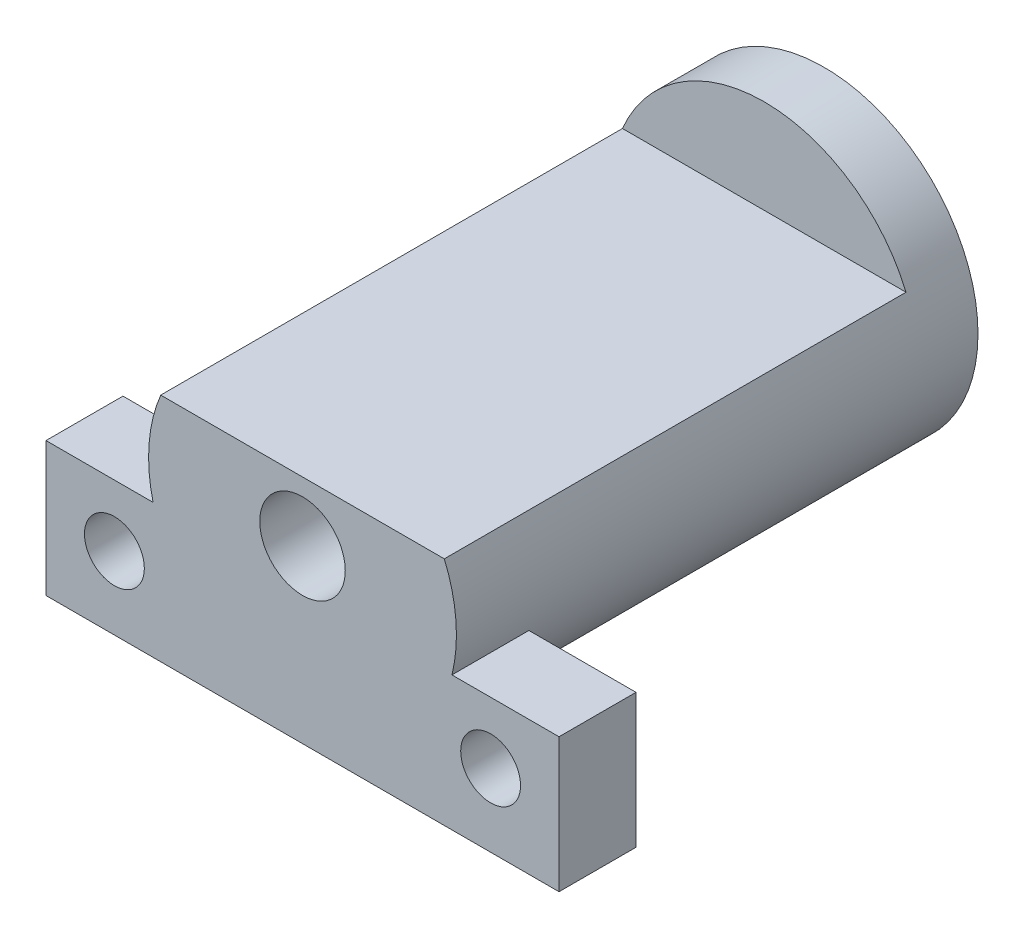
ISO-10303-21;
HEADER;
FILE_DESCRIPTION(('STEP AP214'),'2;1');
FILE_NAME('part.step','',(''),(''),'','','');
FILE_SCHEMA(('AUTOMOTIVE_DESIGN { 1 0 10303 214 1 1 1 1 }'));
ENDSEC;
DATA;
#1=APPLICATION_CONTEXT('core data for automotive mechanical design processes');
#2=APPLICATION_PROTOCOL_DEFINITION('international standard','automotive_design',2000,#1);
#3=PRODUCT_CONTEXT('',#1,'mechanical');
#4=PRODUCT('Part','Part','',(#3));
#5=PRODUCT_RELATED_PRODUCT_CATEGORY('part','',(#4));
#6=PRODUCT_DEFINITION_FORMATION('','',#4);
#7=PRODUCT_DEFINITION_CONTEXT('part definition',#1,'design');
#8=PRODUCT_DEFINITION('design','',#6,#7);
#9=PRODUCT_DEFINITION_SHAPE('','',#8);
#10=(LENGTH_UNIT() NAMED_UNIT(*) SI_UNIT(.MILLI.,.METRE.));
#11=(NAMED_UNIT(*) PLANE_ANGLE_UNIT() SI_UNIT($,.RADIAN.));
#12=(NAMED_UNIT(*) SI_UNIT($,.STERADIAN.) SOLID_ANGLE_UNIT());
#13=UNCERTAINTY_MEASURE_WITH_UNIT(LENGTH_MEASURE(1.E-05),#10,'distance_accuracy_value','');
#14=(GEOMETRIC_REPRESENTATION_CONTEXT(3) GLOBAL_UNCERTAINTY_ASSIGNED_CONTEXT((#13)) GLOBAL_UNIT_ASSIGNED_CONTEXT((#10,
#11,#12)) REPRESENTATION_CONTEXT('',''));
#15=CARTESIAN_POINT('',(0.,0.,0.));
#16=DIRECTION('',(0.,0.,1.));
#17=DIRECTION('',(1.,0.,0.));
#18=AXIS2_PLACEMENT_3D('',#15,#16,#17);
#19=CARTESIAN_POINT('',(0.,0.,61.));
#20=DIRECTION('',(0.,0.,-1.));
#21=DIRECTION('',(-1.,0.,0.));
#22=AXIS2_PLACEMENT_3D('',#19,#20,#21);
#23=CYLINDRICAL_SURFACE('',#22,18.);
#24=CARTESIAN_POINT('',(0.,0.,61.));
#25=DIRECTION('',(0.,0.,1.));
#26=DIRECTION('',(1.,0.,0.));
#27=AXIS2_PLACEMENT_3D('',#24,#25,#26);
#28=CIRCLE('',#27,18.);
#29=CARTESIAN_POINT('',(17.4756756146146,-4.31286005021783,61.));
#30=VERTEX_POINT('',#29);
#31=CARTESIAN_POINT('',(16.583123951777,7.,61.));
#32=VERTEX_POINT('',#31);
#33=EDGE_CURVE('E189',#30,#32,#28,.T.);
#34=ORIENTED_EDGE('',*,*,#33,.F.);
#35=DIRECTION('',(0.,0.,-1.));
#36=VECTOR('',#35,1.);
#37=CARTESIAN_POINT('',(17.4756756146146,-4.31286005021783,61.));
#38=LINE('',#37,#36);
#39=CARTESIAN_POINT('',(17.4756756146146,-4.31286005021783,52.));
#40=VERTEX_POINT('',#39);
#41=EDGE_CURVE('E169',#30,#40,#38,.T.);
#42=ORIENTED_EDGE('',*,*,#41,.T.);
#43=CARTESIAN_POINT('',(0.,0.,52.));
#44=DIRECTION('',(0.,0.,1.));
#45=DIRECTION('',(1.,0.,0.));
#46=AXIS2_PLACEMENT_3D('',#43,#44,#45);
#47=CIRCLE('',#46,18.);
#48=CARTESIAN_POINT('',(-17.4756756146146,-4.31286005021783,52.));
#49=VERTEX_POINT('',#48);
#50=EDGE_CURVE('E11',#49,#40,#47,.T.);
#51=ORIENTED_EDGE('',*,*,#50,.F.);
#52=DIRECTION('',(0.,0.,-1.));
#53=VECTOR('',#52,1.);
#54=CARTESIAN_POINT('',(-17.4756756146146,-4.31286005021783,61.));
#55=LINE('',#54,#53);
#56=CARTESIAN_POINT('',(-17.4756756146146,-4.31286005021783,61.));
#57=VERTEX_POINT('',#56);
#58=EDGE_CURVE('E160',#49,#57,#55,.F.);
#59=ORIENTED_EDGE('',*,*,#58,.T.);
#60=CARTESIAN_POINT('',(-16.583123951777,7.,61.));
#61=VERTEX_POINT('',#60);
#62=EDGE_CURVE('E184',#61,#57,#28,.T.);
#63=ORIENTED_EDGE('',*,*,#62,.F.);
#64=DIRECTION('',(0.,0.,-1.));
#65=VECTOR('',#64,1.);
#66=CARTESIAN_POINT('',(-16.583123951777,7.,61.));
#67=LINE('',#66,#65);
#68=CARTESIAN_POINT('',(-16.583123951777,7.,7.));
#69=VERTEX_POINT('',#68);
#70=EDGE_CURVE('E62',#61,#69,#67,.T.);
#71=ORIENTED_EDGE('',*,*,#70,.T.);
#72=CARTESIAN_POINT('',(0.,0.,7.));
#73=DIRECTION('',(0.,0.,1.));
#74=DIRECTION('',(1.,0.,0.));
#75=AXIS2_PLACEMENT_3D('',#72,#73,#74);
#76=CIRCLE('',#75,18.);
#77=CARTESIAN_POINT('',(16.583123951777,7.,7.));
#78=VERTEX_POINT('',#77);
#79=EDGE_CURVE('E47',#78,#69,#76,.T.);
#80=ORIENTED_EDGE('',*,*,#79,.F.);
#81=DIRECTION('',(0.,0.,-1.));
#82=VECTOR('',#81,1.);
#83=CARTESIAN_POINT('',(16.583123951777,7.,61.));
#84=LINE('',#83,#82);
#85=EDGE_CURVE('E177',#78,#32,#84,.F.);
#86=ORIENTED_EDGE('',*,*,#85,.T.);
#87=EDGE_LOOP('',(#34,#42,#51,#59,#63,#71,#80,#86));
#88=FACE_BOUND('',#87,.T.);
#89=CARTESIAN_POINT('',(0.,0.,0.));
#90=DIRECTION('',(0.,0.,1.));
#91=DIRECTION('',(1.,0.,0.));
#92=AXIS2_PLACEMENT_3D('',#89,#90,#91);
#93=CIRCLE('',#92,18.);
#94=CARTESIAN_POINT('',(18.,0.,0.));
#95=VERTEX_POINT('',#94);
#96=EDGE_CURVE('E183',#95,#95,#93,.T.);
#97=ORIENTED_EDGE('',*,*,#96,.T.);
#98=EDGE_LOOP('',(#97));
#99=FACE_BOUND('',#98,.T.);
#100=ADVANCED_FACE('F39',(#88,#99),#23,.T.);
#101=CARTESIAN_POINT('',(0.,0.,61.));
#102=DIRECTION('',(0.,0.,1.));
#103=DIRECTION('',(1.,0.,0.));
#104=AXIS2_PLACEMENT_3D('',#101,#102,#103);
#105=PLANE('',#104);
#106=CARTESIAN_POINT('',(0.,0.,61.));
#107=DIRECTION('',(0.,0.,1.));
#108=DIRECTION('',(1.,0.,0.));
#109=AXIS2_PLACEMENT_3D('',#106,#107,#108);
#110=CIRCLE('',#109,5.);
#111=CARTESIAN_POINT('',(5.,0.,61.));
#112=VERTEX_POINT('',#111);
#113=EDGE_CURVE('E326',#112,#112,#110,.T.);
#114=ORIENTED_EDGE('',*,*,#113,.F.);
#115=EDGE_LOOP('',(#114));
#116=FACE_BOUND('',#115,.T.);
#117=CARTESIAN_POINT('',(-22.,-11.5128600502178,61.));
#118=DIRECTION('',(0.,0.,1.));
#119=DIRECTION('',(1.,0.,0.));
#120=AXIS2_PLACEMENT_3D('',#117,#118,#119);
#121=CIRCLE('',#120,3.5);
#122=CARTESIAN_POINT('',(-18.5,-11.5128600502178,61.));
#123=VERTEX_POINT('',#122);
#124=EDGE_CURVE('E339',#123,#123,#121,.T.);
#125=ORIENTED_EDGE('',*,*,#124,.F.);
#126=EDGE_LOOP('',(#125));
#127=FACE_BOUND('',#126,.T.);
#128=CARTESIAN_POINT('',(22.,-11.5128600502178,61.));
#129=DIRECTION('',(0.,0.,1.));
#130=DIRECTION('',(1.,0.,0.));
#131=AXIS2_PLACEMENT_3D('',#128,#129,#130);
#132=CIRCLE('',#131,3.5);
#133=CARTESIAN_POINT('',(25.5,-11.5128600502178,61.));
#134=VERTEX_POINT('',#133);
#135=EDGE_CURVE('E141',#134,#134,#132,.T.);
#136=ORIENTED_EDGE('',*,*,#135,.F.);
#137=EDGE_LOOP('',(#136));
#138=FACE_BOUND('',#137,.T.);
#139=ORIENTED_EDGE('',*,*,#62,.T.);
#140=DIRECTION('',(-1.,0.,0.));
#141=VECTOR('',#140,1.);
#142=CARTESIAN_POINT('',(-30.,-4.31286005021783,61.));
#143=LINE('',#142,#141);
#144=CARTESIAN_POINT('',(-30.,-4.31286005021783,61.));
#145=VERTEX_POINT('',#144);
#146=EDGE_CURVE('E138',#57,#145,#143,.T.);
#147=ORIENTED_EDGE('',*,*,#146,.T.);
#148=DIRECTION('',(0.,-1.,0.));
#149=VECTOR('',#148,1.);
#150=CARTESIAN_POINT('',(-30.,-4.31286005021783,61.));
#151=LINE('',#150,#149);
#152=CARTESIAN_POINT('',(-30.,-20.0128600502178,61.));
#153=VERTEX_POINT('',#152);
#154=EDGE_CURVE('E150',#145,#153,#151,.T.);
#155=ORIENTED_EDGE('',*,*,#154,.T.);
#156=DIRECTION('',(1.,0.,0.));
#157=VECTOR('',#156,1.);
#158=CARTESIAN_POINT('',(-30.,-20.0128600502178,61.));
#159=LINE('',#158,#157);
#160=CARTESIAN_POINT('',(30.,-20.0128600502178,61.));
#161=VERTEX_POINT('',#160);
#162=EDGE_CURVE('E111',#153,#161,#159,.T.);
#163=ORIENTED_EDGE('',*,*,#162,.T.);
#164=DIRECTION('',(0.,1.,0.));
#165=VECTOR('',#164,1.);
#166=CARTESIAN_POINT('',(30.,-4.31286005021783,61.));
#167=LINE('',#166,#165);
#168=CARTESIAN_POINT('',(30.,-4.31286005021783,61.));
#169=VERTEX_POINT('',#168);
#170=EDGE_CURVE('E155',#161,#169,#167,.T.);
#171=ORIENTED_EDGE('',*,*,#170,.T.);
#172=EDGE_CURVE('E54',#169,#30,#143,.T.);
#173=ORIENTED_EDGE('',*,*,#172,.T.);
#174=ORIENTED_EDGE('',*,*,#33,.T.);
#175=DIRECTION('',(1.,0.,0.));
#176=VECTOR('',#175,1.);
#177=CARTESIAN_POINT('',(0.,7.,61.));
#178=LINE('',#177,#176);
#179=EDGE_CURVE('E188',#61,#32,#178,.T.);
#180=ORIENTED_EDGE('',*,*,#179,.F.);
#181=EDGE_LOOP('',(#139,#147,#155,#163,#171,#173,#174,#180));
#182=FACE_BOUND('',#181,.T.);
#183=ADVANCED_FACE('F204',(#116,#127,#138,#182),#105,.T.);
#184=CARTESIAN_POINT('',(0.,0.,0.));
#185=DIRECTION('',(0.,0.,1.));
#186=DIRECTION('',(1.,0.,0.));
#187=AXIS2_PLACEMENT_3D('',#184,#185,#186);
#188=PLANE('',#187);
#189=CARTESIAN_POINT('',(0.,0.,0.));
#190=DIRECTION('',(0.,0.,-1.));
#191=DIRECTION('',(-1.,0.,0.));
#192=AXIS2_PLACEMENT_3D('',#189,#190,#191);
#193=CIRCLE('',#192,5.);
#194=CARTESIAN_POINT('',(-5.,0.,0.));
#195=VERTEX_POINT('',#194);
#196=EDGE_CURVE('E329',#195,#195,#193,.T.);
#197=ORIENTED_EDGE('',*,*,#196,.F.);
#198=EDGE_LOOP('',(#197));
#199=FACE_BOUND('',#198,.T.);
#200=ORIENTED_EDGE('',*,*,#96,.F.);
#201=EDGE_LOOP('',(#200));
#202=FACE_BOUND('',#201,.T.);
#203=ADVANCED_FACE('F227',(#199,#202),#188,.F.);
#204=CARTESIAN_POINT('',(0.,0.,7.));
#205=DIRECTION('',(0.,0.,1.));
#206=DIRECTION('',(1.,0.,0.));
#207=AXIS2_PLACEMENT_3D('',#204,#205,#206);
#208=PLANE('',#207);
#209=ORIENTED_EDGE('',*,*,#79,.T.);
#210=DIRECTION('',(1.,0.,0.));
#211=VECTOR('',#210,1.);
#212=CARTESIAN_POINT('',(-17.2897849172903,7.,7.));
#213=LINE('',#212,#211);
#214=EDGE_CURVE('E173',#69,#78,#213,.T.);
#215=ORIENTED_EDGE('',*,*,#214,.T.);
#216=EDGE_LOOP('',(#209,#215));
#217=FACE_BOUND('',#216,.T.);
#218=ADVANCED_FACE('F197',(#217),#208,.T.);
#219=CARTESIAN_POINT('',(-17.2897849172903,7.,7.));
#220=DIRECTION('',(0.,-1.,0.));
#221=DIRECTION('',(0.,0.,-1.));
#222=AXIS2_PLACEMENT_3D('',#219,#220,#221);
#223=PLANE('',#222);
#224=ORIENTED_EDGE('',*,*,#179,.T.);
#225=ORIENTED_EDGE('',*,*,#85,.F.);
#226=ORIENTED_EDGE('',*,*,#214,.F.);
#227=ORIENTED_EDGE('',*,*,#70,.F.);
#228=EDGE_LOOP('',(#224,#225,#226,#227));
#229=FACE_BOUND('',#228,.T.);
#230=ADVANCED_FACE('F199',(#229),#223,.F.);
#231=CARTESIAN_POINT('',(-30.,-4.31286005021783,52.));
#232=DIRECTION('',(0.,1.,0.));
#233=DIRECTION('',(0.,0.,1.));
#234=AXIS2_PLACEMENT_3D('',#231,#232,#233);
#235=PLANE('',#234);
#236=ORIENTED_EDGE('',*,*,#41,.F.);
#237=ORIENTED_EDGE('',*,*,#172,.F.);
#238=DIRECTION('',(0.,0.,1.));
#239=VECTOR('',#238,1.);
#240=CARTESIAN_POINT('',(30.,-4.31286005021783,52.));
#241=LINE('',#240,#239);
#242=CARTESIAN_POINT('',(30.,-4.31286005021783,52.));
#243=VERTEX_POINT('',#242);
#244=EDGE_CURVE('E161',#243,#169,#241,.T.);
#245=ORIENTED_EDGE('',*,*,#244,.F.);
#246=DIRECTION('',(-1.,0.,0.));
#247=VECTOR('',#246,1.);
#248=CARTESIAN_POINT('',(-30.,-4.31286005021783,52.));
#249=LINE('',#248,#247);
#250=EDGE_CURVE('E118',#243,#40,#249,.T.);
#251=ORIENTED_EDGE('',*,*,#250,.T.);
#252=EDGE_LOOP('',(#236,#237,#245,#251));
#253=FACE_BOUND('',#252,.T.);
#254=ADVANCED_FACE('F210',(#253),#235,.T.);
#255=ORIENTED_EDGE('',*,*,#58,.F.);
#256=CARTESIAN_POINT('',(-30.,-4.31286005021783,52.));
#257=VERTEX_POINT('',#256);
#258=EDGE_CURVE('E146',#49,#257,#249,.T.);
#259=ORIENTED_EDGE('',*,*,#258,.T.);
#260=DIRECTION('',(0.,0.,1.));
#261=VECTOR('',#260,1.);
#262=CARTESIAN_POINT('',(-30.,-4.31286005021783,52.));
#263=LINE('',#262,#261);
#264=EDGE_CURVE('E134',#257,#145,#263,.T.);
#265=ORIENTED_EDGE('',*,*,#264,.T.);
#266=ORIENTED_EDGE('',*,*,#146,.F.);
#267=EDGE_LOOP('',(#255,#259,#265,#266));
#268=FACE_BOUND('',#267,.T.);
#269=ADVANCED_FACE('F208',(#268),#235,.T.);
#270=CARTESIAN_POINT('',(-30.,-4.31286005021783,52.));
#271=DIRECTION('',(-1.,0.,0.));
#272=DIRECTION('',(0.,-1.,0.));
#273=AXIS2_PLACEMENT_3D('',#270,#271,#272);
#274=PLANE('',#273);
#275=ORIENTED_EDGE('',*,*,#154,.F.);
#276=ORIENTED_EDGE('',*,*,#264,.F.);
#277=DIRECTION('',(0.,-1.,0.));
#278=VECTOR('',#277,1.);
#279=CARTESIAN_POINT('',(-30.,-4.31286005021783,52.));
#280=LINE('',#279,#278);
#281=CARTESIAN_POINT('',(-30.,-20.0128600502178,52.));
#282=VERTEX_POINT('',#281);
#283=EDGE_CURVE('E125',#257,#282,#280,.T.);
#284=ORIENTED_EDGE('',*,*,#283,.T.);
#285=DIRECTION('',(0.,0.,1.));
#286=VECTOR('',#285,1.);
#287=CARTESIAN_POINT('',(-30.,-20.0128600502178,52.));
#288=LINE('',#287,#286);
#289=EDGE_CURVE('E106',#282,#153,#288,.T.);
#290=ORIENTED_EDGE('',*,*,#289,.T.);
#291=EDGE_LOOP('',(#275,#276,#284,#290));
#292=FACE_BOUND('',#291,.T.);
#293=ADVANCED_FACE('F132',(#292),#274,.T.);
#294=CARTESIAN_POINT('',(30.,-4.31286005021783,52.));
#295=DIRECTION('',(1.,0.,0.));
#296=DIRECTION('',(0.,1.,0.));
#297=AXIS2_PLACEMENT_3D('',#294,#295,#296);
#298=PLANE('',#297);
#299=ORIENTED_EDGE('',*,*,#170,.F.);
#300=DIRECTION('',(0.,0.,1.));
#301=VECTOR('',#300,1.);
#302=CARTESIAN_POINT('',(30.,-20.0128600502178,52.));
#303=LINE('',#302,#301);
#304=CARTESIAN_POINT('',(30.,-20.0128600502178,52.));
#305=VERTEX_POINT('',#304);
#306=EDGE_CURVE('E117',#305,#161,#303,.T.);
#307=ORIENTED_EDGE('',*,*,#306,.F.);
#308=DIRECTION('',(0.,1.,0.));
#309=VECTOR('',#308,1.);
#310=CARTESIAN_POINT('',(30.,-4.31286005021783,52.));
#311=LINE('',#310,#309);
#312=EDGE_CURVE('E128',#305,#243,#311,.T.);
#313=ORIENTED_EDGE('',*,*,#312,.T.);
#314=ORIENTED_EDGE('',*,*,#244,.T.);
#315=EDGE_LOOP('',(#299,#307,#313,#314));
#316=FACE_BOUND('',#315,.T.);
#317=ADVANCED_FACE('F213',(#316),#298,.T.);
#318=CARTESIAN_POINT('',(-30.,-20.0128600502178,52.));
#319=DIRECTION('',(0.,-1.,0.));
#320=DIRECTION('',(0.,0.,-1.));
#321=AXIS2_PLACEMENT_3D('',#318,#319,#320);
#322=PLANE('',#321);
#323=ORIENTED_EDGE('',*,*,#162,.F.);
#324=ORIENTED_EDGE('',*,*,#289,.F.);
#325=DIRECTION('',(1.,0.,0.));
#326=VECTOR('',#325,1.);
#327=CARTESIAN_POINT('',(-30.,-20.0128600502178,52.));
#328=LINE('',#327,#326);
#329=EDGE_CURVE('E109',#282,#305,#328,.T.);
#330=ORIENTED_EDGE('',*,*,#329,.T.);
#331=ORIENTED_EDGE('',*,*,#306,.T.);
#332=EDGE_LOOP('',(#323,#324,#330,#331));
#333=FACE_BOUND('',#332,.T.);
#334=ADVANCED_FACE('F108',(#333),#322,.T.);
#335=CARTESIAN_POINT('',(0.,0.,52.));
#336=DIRECTION('',(0.,0.,1.));
#337=DIRECTION('',(1.,0.,0.));
#338=AXIS2_PLACEMENT_3D('',#335,#336,#337);
#339=PLANE('',#338);
#340=CARTESIAN_POINT('',(-22.,-11.5128600502178,52.));
#341=DIRECTION('',(0.,0.,-1.));
#342=DIRECTION('',(-1.,0.,0.));
#343=AXIS2_PLACEMENT_3D('',#340,#341,#342);
#344=CIRCLE('',#343,3.5);
#345=CARTESIAN_POINT('',(-25.5,-11.5128600502178,52.));
#346=VERTEX_POINT('',#345);
#347=EDGE_CURVE('E333',#346,#346,#344,.T.);
#348=ORIENTED_EDGE('',*,*,#347,.F.);
#349=EDGE_LOOP('',(#348));
#350=FACE_BOUND('',#349,.T.);
#351=CARTESIAN_POINT('',(22.,-11.5128600502178,52.));
#352=DIRECTION('',(0.,0.,-1.));
#353=DIRECTION('',(-1.,0.,0.));
#354=AXIS2_PLACEMENT_3D('',#351,#352,#353);
#355=CIRCLE('',#354,3.5);
#356=CARTESIAN_POINT('',(18.5,-11.5128600502178,52.));
#357=VERTEX_POINT('',#356);
#358=EDGE_CURVE('E342',#357,#357,#355,.T.);
#359=ORIENTED_EDGE('',*,*,#358,.F.);
#360=EDGE_LOOP('',(#359));
#361=FACE_BOUND('',#360,.T.);
#362=ORIENTED_EDGE('',*,*,#258,.F.);
#363=ORIENTED_EDGE('',*,*,#50,.T.);
#364=ORIENTED_EDGE('',*,*,#250,.F.);
#365=ORIENTED_EDGE('',*,*,#312,.F.);
#366=ORIENTED_EDGE('',*,*,#329,.F.);
#367=ORIENTED_EDGE('',*,*,#283,.F.);
#368=EDGE_LOOP('',(#362,#363,#364,#365,#366,#367));
#369=FACE_BOUND('',#368,.T.);
#370=ADVANCED_FACE('F124',(#350,#361,#369),#339,.F.);
#371=CARTESIAN_POINT('',(22.,-11.5128600502178,62.));
#372=DIRECTION('',(0.,0.,-1.));
#373=DIRECTION('',(-1.,0.,0.));
#374=AXIS2_PLACEMENT_3D('',#371,#372,#373);
#375=CYLINDRICAL_SURFACE('',#374,3.5);
#376=ORIENTED_EDGE('',*,*,#135,.T.);
#377=EDGE_LOOP('',(#376));
#378=FACE_BOUND('',#377,.T.);
#379=ORIENTED_EDGE('',*,*,#358,.T.);
#380=EDGE_LOOP('',(#379));
#381=FACE_BOUND('',#380,.T.);
#382=ADVANCED_FACE('F279',(#378,#381),#375,.F.);
#383=CARTESIAN_POINT('',(-22.,-11.5128600502178,62.));
#384=DIRECTION('',(0.,0.,-1.));
#385=DIRECTION('',(-1.,0.,0.));
#386=AXIS2_PLACEMENT_3D('',#383,#384,#385);
#387=CYLINDRICAL_SURFACE('',#386,3.5);
#388=ORIENTED_EDGE('',*,*,#124,.T.);
#389=EDGE_LOOP('',(#388));
#390=FACE_BOUND('',#389,.T.);
#391=ORIENTED_EDGE('',*,*,#347,.T.);
#392=EDGE_LOOP('',(#391));
#393=FACE_BOUND('',#392,.T.);
#394=ADVANCED_FACE('F284',(#390,#393),#387,.F.);
#395=CARTESIAN_POINT('',(0.,0.,100.));
#396=DIRECTION('',(0.,0.,-1.));
#397=DIRECTION('',(-1.,0.,0.));
#398=AXIS2_PLACEMENT_3D('',#395,#396,#397);
#399=CYLINDRICAL_SURFACE('',#398,5.);
#400=ORIENTED_EDGE('',*,*,#113,.T.);
#401=EDGE_LOOP('',(#400));
#402=FACE_BOUND('',#401,.T.);
#403=ORIENTED_EDGE('',*,*,#196,.T.);
#404=EDGE_LOOP('',(#403));
#405=FACE_BOUND('',#404,.T.);
#406=ADVANCED_FACE('F300',(#402,#405),#399,.F.);
#407=CLOSED_SHELL('',(#100,#183,#203,#218,#230,#254,#269,#293,#317,#334,#370,#382,#394,#406));
#408=MANIFOLD_SOLID_BREP('B2',#407);
#409=ADVANCED_BREP_SHAPE_REPRESENTATION('',(#18,#408),#14);
#410=SHAPE_DEFINITION_REPRESENTATION(#9,#409);
ENDSEC;
END-ISO-10303-21;
